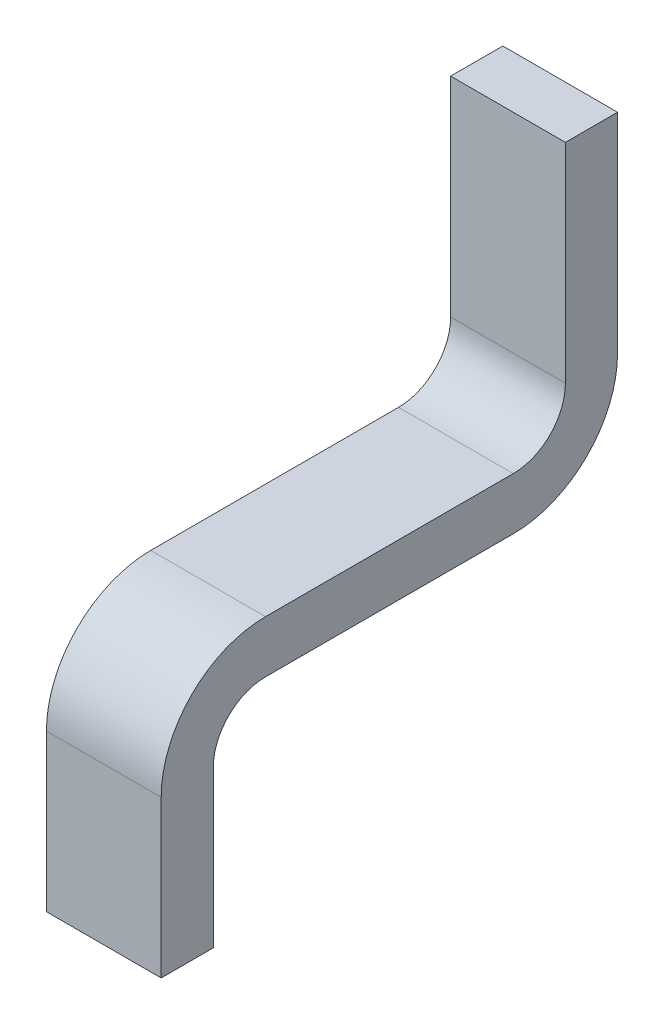
ISO-10303-21;
HEADER;
FILE_DESCRIPTION(('STEP AP214'),'2;1');
FILE_NAME('part.step','',(''),(''),'','','');
FILE_SCHEMA(('AUTOMOTIVE_DESIGN { 1 0 10303 214 1 1 1 1 }'));
ENDSEC;
DATA;
#1=APPLICATION_CONTEXT('core data for automotive mechanical design processes');
#2=APPLICATION_PROTOCOL_DEFINITION('international standard','automotive_design',2000,#1);
#3=PRODUCT_CONTEXT('',#1,'mechanical');
#4=PRODUCT('Part','Part','',(#3));
#5=PRODUCT_RELATED_PRODUCT_CATEGORY('part','',(#4));
#6=PRODUCT_DEFINITION_FORMATION('','',#4);
#7=PRODUCT_DEFINITION_CONTEXT('part definition',#1,'design');
#8=PRODUCT_DEFINITION('design','',#6,#7);
#9=PRODUCT_DEFINITION_SHAPE('','',#8);
#10=(LENGTH_UNIT() NAMED_UNIT(*) SI_UNIT(.MILLI.,.METRE.));
#11=(NAMED_UNIT(*) PLANE_ANGLE_UNIT() SI_UNIT($,.RADIAN.));
#12=(NAMED_UNIT(*) SI_UNIT($,.STERADIAN.) SOLID_ANGLE_UNIT());
#13=UNCERTAINTY_MEASURE_WITH_UNIT(LENGTH_MEASURE(1.E-05),#10,'distance_accuracy_value','');
#14=(GEOMETRIC_REPRESENTATION_CONTEXT(3) GLOBAL_UNCERTAINTY_ASSIGNED_CONTEXT((#13)) GLOBAL_UNIT_ASSIGNED_CONTEXT((#10,
#11,#12)) REPRESENTATION_CONTEXT('',''));
#15=CARTESIAN_POINT('',(0.,0.,0.));
#16=DIRECTION('',(0.,0.,1.));
#17=DIRECTION('',(1.,0.,0.));
#18=AXIS2_PLACEMENT_3D('',#15,#16,#17);
#19=CARTESIAN_POINT('',(-1.14,4.,0.675));
#20=DIRECTION('',(-1.,0.,0.));
#21=DIRECTION('',(0.,-1.,0.));
#22=AXIS2_PLACEMENT_3D('',#19,#20,#21);
#23=PLANE('',#22);
#24=CARTESIAN_POINT('',(-1.14,3.80000000000001,0.675));
#25=DIRECTION('',(1.,0.,0.));
#26=DIRECTION('',(0.,1.,0.));
#27=AXIS2_PLACEMENT_3D('',#24,#25,#26);
#28=CIRCLE('',#27,0.2);
#29=CARTESIAN_POINT('',(-1.14,3.80000000000001,0.875));
#30=VERTEX_POINT('',#29);
#31=CARTESIAN_POINT('',(-1.14,4.,0.675));
#32=VERTEX_POINT('',#31);
#33=EDGE_CURVE('E150',#30,#32,#28,.F.);
#34=ORIENTED_EDGE('',*,*,#33,.F.);
#35=DIRECTION('',(0.,1.,0.));
#36=VECTOR('',#35,1.);
#37=CARTESIAN_POINT('',(-1.14,3.5,0.875));
#38=LINE('',#37,#36);
#39=CARTESIAN_POINT('',(-1.14,3.5,0.875));
#40=VERTEX_POINT('',#39);
#41=EDGE_CURVE('E147',#30,#40,#38,.F.);
#42=ORIENTED_EDGE('',*,*,#41,.T.);
#43=DIRECTION('',(0.,0.,1.));
#44=VECTOR('',#43,1.);
#45=CARTESIAN_POINT('',(-1.14,3.5,0.775));
#46=LINE('',#45,#44);
#47=CARTESIAN_POINT('',(-1.14,3.5,0.775));
#48=VERTEX_POINT('',#47);
#49=EDGE_CURVE('E141',#48,#40,#46,.T.);
#50=ORIENTED_EDGE('',*,*,#49,.F.);
#51=DIRECTION('',(0.,1.,0.));
#52=VECTOR('',#51,1.);
#53=CARTESIAN_POINT('',(-1.14,3.5,0.775));
#54=LINE('',#53,#52);
#55=CARTESIAN_POINT('',(-1.14,3.80000000000001,0.775));
#56=VERTEX_POINT('',#55);
#57=EDGE_CURVE('E115',#48,#56,#54,.T.);
#58=ORIENTED_EDGE('',*,*,#57,.T.);
#59=CARTESIAN_POINT('',(-1.14,3.80000000000001,0.675));
#60=DIRECTION('',(1.,0.,0.));
#61=DIRECTION('',(0.,1.,0.));
#62=AXIS2_PLACEMENT_3D('',#59,#60,#61);
#63=CIRCLE('',#62,0.1);
#64=CARTESIAN_POINT('',(-1.14,3.9,0.675));
#65=VERTEX_POINT('',#64);
#66=EDGE_CURVE('E215',#56,#65,#63,.F.);
#67=ORIENTED_EDGE('',*,*,#66,.T.);
#68=DIRECTION('',(0.,0.,1.));
#69=VECTOR('',#68,1.);
#70=CARTESIAN_POINT('',(-1.14,3.9,0.675));
#71=LINE('',#70,#69);
#72=CARTESIAN_POINT('',(-1.14,3.9,0.2));
#73=VERTEX_POINT('',#72);
#74=EDGE_CURVE('E181',#65,#73,#71,.F.);
#75=ORIENTED_EDGE('',*,*,#74,.T.);
#76=CARTESIAN_POINT('',(-1.14,4.1,0.2));
#77=DIRECTION('',(-1.,0.,0.));
#78=DIRECTION('',(0.,-1.,0.));
#79=AXIS2_PLACEMENT_3D('',#76,#77,#78);
#80=CIRCLE('',#79,0.2);
#81=CARTESIAN_POINT('',(-1.14,4.1,0.));
#82=VERTEX_POINT('',#81);
#83=EDGE_CURVE('E20',#82,#73,#80,.T.);
#84=ORIENTED_EDGE('',*,*,#83,.F.);
#85=DIRECTION('',(0.,1.,0.));
#86=VECTOR('',#85,1.);
#87=CARTESIAN_POINT('',(-1.14,4.1,0.));
#88=LINE('',#87,#86);
#89=CARTESIAN_POINT('',(-1.14,4.5,0.));
#90=VERTEX_POINT('',#89);
#91=EDGE_CURVE('E91',#82,#90,#88,.T.);
#92=ORIENTED_EDGE('',*,*,#91,.T.);
#93=DIRECTION('',(0.,0.,1.));
#94=VECTOR('',#93,1.);
#95=CARTESIAN_POINT('',(-1.14,4.5,0.));
#96=LINE('',#95,#94);
#97=CARTESIAN_POINT('',(-1.14,4.5,0.1));
#98=VERTEX_POINT('',#97);
#99=EDGE_CURVE('E163',#90,#98,#96,.T.);
#100=ORIENTED_EDGE('',*,*,#99,.T.);
#101=DIRECTION('',(0.,1.,0.));
#102=VECTOR('',#101,1.);
#103=CARTESIAN_POINT('',(-1.14,4.1,0.1));
#104=LINE('',#103,#102);
#105=CARTESIAN_POINT('',(-1.14,4.1,0.1));
#106=VERTEX_POINT('',#105);
#107=EDGE_CURVE('E159',#98,#106,#104,.F.);
#108=ORIENTED_EDGE('',*,*,#107,.T.);
#109=CARTESIAN_POINT('',(-1.14,4.1,0.2));
#110=DIRECTION('',(-1.,0.,0.));
#111=DIRECTION('',(0.,-1.,0.));
#112=AXIS2_PLACEMENT_3D('',#109,#110,#111);
#113=CIRCLE('',#112,0.1);
#114=CARTESIAN_POINT('',(-1.14,4.,0.2));
#115=VERTEX_POINT('',#114);
#116=EDGE_CURVE('E155',#106,#115,#113,.T.);
#117=ORIENTED_EDGE('',*,*,#116,.T.);
#118=DIRECTION('',(0.,0.,1.));
#119=VECTOR('',#118,1.);
#120=CARTESIAN_POINT('',(-1.14,4.,0.675));
#121=LINE('',#120,#119);
#122=EDGE_CURVE('E154',#115,#32,#121,.T.);
#123=ORIENTED_EDGE('',*,*,#122,.T.);
#124=EDGE_LOOP('',(#34,#42,#50,#58,#67,#75,#84,#92,#100,#108,#117,#123));
#125=FACE_BOUND('',#124,.T.);
#126=ADVANCED_FACE('F17',(#125),#23,.F.);
#127=CARTESIAN_POINT('',(-1.14,4.1,0.2));
#128=DIRECTION('',(-1.,0.,0.));
#129=DIRECTION('',(0.,-1.,0.));
#130=AXIS2_PLACEMENT_3D('',#127,#128,#129);
#131=CYLINDRICAL_SURFACE('',#130,0.2);
#132=CARTESIAN_POINT('',(-1.36,4.1,0.2));
#133=DIRECTION('',(-1.,0.,0.));
#134=DIRECTION('',(0.,-1.,0.));
#135=AXIS2_PLACEMENT_3D('',#132,#133,#134);
#136=CIRCLE('',#135,0.2);
#137=CARTESIAN_POINT('',(-1.36,3.9,0.2));
#138=VERTEX_POINT('',#137);
#139=CARTESIAN_POINT('',(-1.36,4.1,0.));
#140=VERTEX_POINT('',#139);
#141=EDGE_CURVE('E183',#138,#140,#136,.F.);
#142=ORIENTED_EDGE('',*,*,#141,.T.);
#143=DIRECTION('',(1.,0.,0.));
#144=VECTOR('',#143,1.);
#145=CARTESIAN_POINT('',(-1.14,4.1,0.));
#146=LINE('',#145,#144);
#147=EDGE_CURVE('E178',#140,#82,#146,.T.);
#148=ORIENTED_EDGE('',*,*,#147,.T.);
#149=ORIENTED_EDGE('',*,*,#83,.T.);
#150=DIRECTION('',(-1.,0.,0.));
#151=VECTOR('',#150,1.);
#152=CARTESIAN_POINT('',(-1.14,3.9,0.2));
#153=LINE('',#152,#151);
#154=EDGE_CURVE('E217',#73,#138,#153,.T.);
#155=ORIENTED_EDGE('',*,*,#154,.T.);
#156=EDGE_LOOP('',(#142,#148,#149,#155));
#157=FACE_BOUND('',#156,.T.);
#158=ADVANCED_FACE('F254',(#157),#131,.T.);
#159=CARTESIAN_POINT('',(-1.14,4.1,0.));
#160=DIRECTION('',(0.,0.,1.));
#161=DIRECTION('',(1.,0.,0.));
#162=AXIS2_PLACEMENT_3D('',#159,#160,#161);
#163=PLANE('',#162);
#164=ORIENTED_EDGE('',*,*,#147,.F.);
#165=DIRECTION('',(0.,1.,0.));
#166=VECTOR('',#165,1.);
#167=CARTESIAN_POINT('',(-1.36,3.9,0.));
#168=LINE('',#167,#166);
#169=CARTESIAN_POINT('',(-1.36,4.5,0.));
#170=VERTEX_POINT('',#169);
#171=EDGE_CURVE('E170',#140,#170,#168,.T.);
#172=ORIENTED_EDGE('',*,*,#171,.T.);
#173=DIRECTION('',(1.,0.,0.));
#174=VECTOR('',#173,1.);
#175=CARTESIAN_POINT('',(-1.14,4.5,0.));
#176=LINE('',#175,#174);
#177=EDGE_CURVE('E173',#170,#90,#176,.T.);
#178=ORIENTED_EDGE('',*,*,#177,.T.);
#179=ORIENTED_EDGE('',*,*,#91,.F.);
#180=EDGE_LOOP('',(#164,#172,#178,#179));
#181=FACE_BOUND('',#180,.T.);
#182=ADVANCED_FACE('F257',(#181),#163,.F.);
#183=CARTESIAN_POINT('',(-1.14,4.5,0.));
#184=DIRECTION('',(0.,-1.,0.));
#185=DIRECTION('',(1.,0.,0.));
#186=AXIS2_PLACEMENT_3D('',#183,#184,#185);
#187=PLANE('',#186);
#188=DIRECTION('',(-1.,0.,0.));
#189=VECTOR('',#188,1.);
#190=CARTESIAN_POINT('',(-1.36,4.5,0.1));
#191=LINE('',#190,#189);
#192=CARTESIAN_POINT('',(-1.36,4.5,0.1));
#193=VERTEX_POINT('',#192);
#194=EDGE_CURVE('E160',#193,#98,#191,.F.);
#195=ORIENTED_EDGE('',*,*,#194,.T.);
#196=ORIENTED_EDGE('',*,*,#99,.F.);
#197=ORIENTED_EDGE('',*,*,#177,.F.);
#198=DIRECTION('',(0.,0.,1.));
#199=VECTOR('',#198,1.);
#200=CARTESIAN_POINT('',(-1.36,4.5,0.675));
#201=LINE('',#200,#199);
#202=EDGE_CURVE('E166',#170,#193,#201,.T.);
#203=ORIENTED_EDGE('',*,*,#202,.T.);
#204=EDGE_LOOP('',(#195,#196,#197,#203));
#205=FACE_BOUND('',#204,.T.);
#206=ADVANCED_FACE('F259',(#205),#187,.F.);
#207=CARTESIAN_POINT('',(-1.36,4.1,0.1));
#208=DIRECTION('',(0.,0.,-1.));
#209=DIRECTION('',(-1.,0.,0.));
#210=AXIS2_PLACEMENT_3D('',#207,#208,#209);
#211=PLANE('',#210);
#212=DIRECTION('',(-1.,0.,0.));
#213=VECTOR('',#212,1.);
#214=CARTESIAN_POINT('',(-1.36,4.1,0.1));
#215=LINE('',#214,#213);
#216=CARTESIAN_POINT('',(-1.36,4.1,0.1));
#217=VERTEX_POINT('',#216);
#218=EDGE_CURVE('E156',#217,#106,#215,.F.);
#219=ORIENTED_EDGE('',*,*,#218,.T.);
#220=ORIENTED_EDGE('',*,*,#107,.F.);
#221=ORIENTED_EDGE('',*,*,#194,.F.);
#222=DIRECTION('',(0.,1.,0.));
#223=VECTOR('',#222,1.);
#224=CARTESIAN_POINT('',(-1.36,3.9,0.1));
#225=LINE('',#224,#223);
#226=EDGE_CURVE('E169',#193,#217,#225,.F.);
#227=ORIENTED_EDGE('',*,*,#226,.T.);
#228=EDGE_LOOP('',(#219,#220,#221,#227));
#229=FACE_BOUND('',#228,.T.);
#230=ADVANCED_FACE('F234',(#229),#211,.F.);
#231=CARTESIAN_POINT('',(-1.36,4.1,0.2));
#232=DIRECTION('',(-1.,0.,0.));
#233=DIRECTION('',(0.,-1.,0.));
#234=AXIS2_PLACEMENT_3D('',#231,#232,#233);
#235=CYLINDRICAL_SURFACE('',#234,0.1);
#236=DIRECTION('',(1.,0.,0.));
#237=VECTOR('',#236,1.);
#238=CARTESIAN_POINT('',(-1.36,4.,0.2));
#239=LINE('',#238,#237);
#240=CARTESIAN_POINT('',(-1.36,4.,0.2));
#241=VERTEX_POINT('',#240);
#242=EDGE_CURVE('E151',#241,#115,#239,.T.);
#243=ORIENTED_EDGE('',*,*,#242,.T.);
#244=ORIENTED_EDGE('',*,*,#116,.F.);
#245=ORIENTED_EDGE('',*,*,#218,.F.);
#246=CARTESIAN_POINT('',(-1.36,4.1,0.2));
#247=DIRECTION('',(-1.,0.,0.));
#248=DIRECTION('',(0.,-1.,0.));
#249=AXIS2_PLACEMENT_3D('',#246,#247,#248);
#250=CIRCLE('',#249,0.1);
#251=EDGE_CURVE('E210',#217,#241,#250,.T.);
#252=ORIENTED_EDGE('',*,*,#251,.T.);
#253=EDGE_LOOP('',(#243,#244,#245,#252));
#254=FACE_BOUND('',#253,.T.);
#255=ADVANCED_FACE('F227',(#254),#235,.F.);
#256=CARTESIAN_POINT('',(-1.36,4.,0.675));
#257=DIRECTION('',(0.,-1.,0.));
#258=DIRECTION('',(1.,0.,0.));
#259=AXIS2_PLACEMENT_3D('',#256,#257,#258);
#260=PLANE('',#259);
#261=DIRECTION('',(1.,0.,0.));
#262=VECTOR('',#261,1.);
#263=CARTESIAN_POINT('',(-1.36,4.,0.675));
#264=LINE('',#263,#262);
#265=CARTESIAN_POINT('',(-1.36,4.,0.675));
#266=VERTEX_POINT('',#265);
#267=EDGE_CURVE('E148',#32,#266,#264,.F.);
#268=ORIENTED_EDGE('',*,*,#267,.F.);
#269=ORIENTED_EDGE('',*,*,#122,.F.);
#270=ORIENTED_EDGE('',*,*,#242,.F.);
#271=DIRECTION('',(0.,0.,1.));
#272=VECTOR('',#271,1.);
#273=CARTESIAN_POINT('',(-1.36,4.,0.675));
#274=LINE('',#273,#272);
#275=EDGE_CURVE('E209',#241,#266,#274,.T.);
#276=ORIENTED_EDGE('',*,*,#275,.T.);
#277=EDGE_LOOP('',(#268,#269,#270,#276));
#278=FACE_BOUND('',#277,.T.);
#279=ADVANCED_FACE('F224',(#278),#260,.F.);
#280=CARTESIAN_POINT('',(-1.36,3.8,0.675));
#281=DIRECTION('',(1.,0.,0.));
#282=DIRECTION('',(0.,1.,0.));
#283=AXIS2_PLACEMENT_3D('',#280,#281,#282);
#284=CYLINDRICAL_SURFACE('',#283,0.2);
#285=ORIENTED_EDGE('',*,*,#33,.T.);
#286=ORIENTED_EDGE('',*,*,#267,.T.);
#287=CARTESIAN_POINT('',(-1.36,3.8,0.675));
#288=DIRECTION('',(1.,0.,0.));
#289=DIRECTION('',(0.,1.,0.));
#290=AXIS2_PLACEMENT_3D('',#287,#288,#289);
#291=CIRCLE('',#290,0.2);
#292=CARTESIAN_POINT('',(-1.36,3.8,0.875));
#293=VERTEX_POINT('',#292);
#294=EDGE_CURVE('E133',#266,#293,#291,.T.);
#295=ORIENTED_EDGE('',*,*,#294,.T.);
#296=DIRECTION('',(-1.,0.,0.));
#297=VECTOR('',#296,1.);
#298=CARTESIAN_POINT('',(-1.36,3.8,0.875));
#299=LINE('',#298,#297);
#300=EDGE_CURVE('E144',#293,#30,#299,.F.);
#301=ORIENTED_EDGE('',*,*,#300,.T.);
#302=EDGE_LOOP('',(#285,#286,#295,#301));
#303=FACE_BOUND('',#302,.T.);
#304=ADVANCED_FACE('F285',(#303),#284,.T.);
#305=CARTESIAN_POINT('',(-1.36,3.5,0.875));
#306=DIRECTION('',(0.,0.,-1.));
#307=DIRECTION('',(-1.,0.,0.));
#308=AXIS2_PLACEMENT_3D('',#305,#306,#307);
#309=PLANE('',#308);
#310=DIRECTION('',(1.,0.,0.));
#311=VECTOR('',#310,1.);
#312=CARTESIAN_POINT('',(-1.14,3.5,0.875));
#313=LINE('',#312,#311);
#314=CARTESIAN_POINT('',(-1.36,3.5,0.875));
#315=VERTEX_POINT('',#314);
#316=EDGE_CURVE('E118',#40,#315,#313,.F.);
#317=ORIENTED_EDGE('',*,*,#316,.F.);
#318=ORIENTED_EDGE('',*,*,#41,.F.);
#319=ORIENTED_EDGE('',*,*,#300,.F.);
#320=DIRECTION('',(0.,1.,0.));
#321=VECTOR('',#320,1.);
#322=CARTESIAN_POINT('',(-1.36,3.9,0.875));
#323=LINE('',#322,#321);
#324=EDGE_CURVE('E131',#293,#315,#323,.F.);
#325=ORIENTED_EDGE('',*,*,#324,.T.);
#326=EDGE_LOOP('',(#317,#318,#319,#325));
#327=FACE_BOUND('',#326,.T.);
#328=ADVANCED_FACE('F282',(#327),#309,.F.);
#329=CARTESIAN_POINT('',(-1.14,3.5,0.775));
#330=DIRECTION('',(0.,-1.,0.));
#331=DIRECTION('',(1.,0.,0.));
#332=AXIS2_PLACEMENT_3D('',#329,#330,#331);
#333=PLANE('',#332);
#334=ORIENTED_EDGE('',*,*,#49,.T.);
#335=ORIENTED_EDGE('',*,*,#316,.T.);
#336=DIRECTION('',(0.,0.,1.));
#337=VECTOR('',#336,1.);
#338=CARTESIAN_POINT('',(-1.36,3.5,0.675));
#339=LINE('',#338,#337);
#340=CARTESIAN_POINT('',(-1.36,3.5,0.775));
#341=VERTEX_POINT('',#340);
#342=EDGE_CURVE('E125',#315,#341,#339,.F.);
#343=ORIENTED_EDGE('',*,*,#342,.T.);
#344=DIRECTION('',(1.,0.,0.));
#345=VECTOR('',#344,1.);
#346=CARTESIAN_POINT('',(-1.14,3.5,0.775));
#347=LINE('',#346,#345);
#348=EDGE_CURVE('E110',#341,#48,#347,.T.);
#349=ORIENTED_EDGE('',*,*,#348,.T.);
#350=EDGE_LOOP('',(#334,#335,#343,#349));
#351=FACE_BOUND('',#350,.T.);
#352=ADVANCED_FACE('F129',(#351),#333,.T.);
#353=CARTESIAN_POINT('',(-1.14,3.5,0.775));
#354=DIRECTION('',(0.,0.,1.));
#355=DIRECTION('',(1.,0.,0.));
#356=AXIS2_PLACEMENT_3D('',#353,#354,#355);
#357=PLANE('',#356);
#358=ORIENTED_EDGE('',*,*,#348,.F.);
#359=DIRECTION('',(0.,1.,0.));
#360=VECTOR('',#359,1.);
#361=CARTESIAN_POINT('',(-1.36,3.9,0.775));
#362=LINE('',#361,#360);
#363=CARTESIAN_POINT('',(-1.36,3.8,0.775));
#364=VERTEX_POINT('',#363);
#365=EDGE_CURVE('E114',#341,#364,#362,.T.);
#366=ORIENTED_EDGE('',*,*,#365,.T.);
#367=DIRECTION('',(1.,0.,0.));
#368=VECTOR('',#367,1.);
#369=CARTESIAN_POINT('',(-1.14,3.80000000000001,0.775));
#370=LINE('',#369,#368);
#371=EDGE_CURVE('E185',#364,#56,#370,.T.);
#372=ORIENTED_EDGE('',*,*,#371,.T.);
#373=ORIENTED_EDGE('',*,*,#57,.F.);
#374=EDGE_LOOP('',(#358,#366,#372,#373));
#375=FACE_BOUND('',#374,.T.);
#376=ADVANCED_FACE('F112',(#375),#357,.F.);
#377=CARTESIAN_POINT('',(-1.14,3.80000000000001,0.675));
#378=DIRECTION('',(1.,0.,0.));
#379=DIRECTION('',(0.,1.,0.));
#380=AXIS2_PLACEMENT_3D('',#377,#378,#379);
#381=CYLINDRICAL_SURFACE('',#380,0.1);
#382=ORIENTED_EDGE('',*,*,#371,.F.);
#383=CARTESIAN_POINT('',(-1.36,3.8,0.675));
#384=DIRECTION('',(1.,0.,0.));
#385=DIRECTION('',(0.,1.,0.));
#386=AXIS2_PLACEMENT_3D('',#383,#384,#385);
#387=CIRCLE('',#386,0.1);
#388=CARTESIAN_POINT('',(-1.36,3.9,0.675));
#389=VERTEX_POINT('',#388);
#390=EDGE_CURVE('E26',#364,#389,#387,.F.);
#391=ORIENTED_EDGE('',*,*,#390,.T.);
#392=DIRECTION('',(-1.,0.,0.));
#393=VECTOR('',#392,1.);
#394=CARTESIAN_POINT('',(-1.14,3.9,0.675));
#395=LINE('',#394,#393);
#396=EDGE_CURVE('E34',#389,#65,#395,.F.);
#397=ORIENTED_EDGE('',*,*,#396,.T.);
#398=ORIENTED_EDGE('',*,*,#66,.F.);
#399=EDGE_LOOP('',(#382,#391,#397,#398));
#400=FACE_BOUND('',#399,.T.);
#401=ADVANCED_FACE('F250',(#400),#381,.F.);
#402=CARTESIAN_POINT('',(-1.14,3.9,0.675));
#403=DIRECTION('',(0.,1.,0.));
#404=DIRECTION('',(-1.,0.,0.));
#405=AXIS2_PLACEMENT_3D('',#402,#403,#404);
#406=PLANE('',#405);
#407=ORIENTED_EDGE('',*,*,#396,.F.);
#408=DIRECTION('',(0.,0.,1.));
#409=VECTOR('',#408,1.);
#410=CARTESIAN_POINT('',(-1.36,3.9,0.675));
#411=LINE('',#410,#409);
#412=EDGE_CURVE('E11',#389,#138,#411,.F.);
#413=ORIENTED_EDGE('',*,*,#412,.T.);
#414=ORIENTED_EDGE('',*,*,#154,.F.);
#415=ORIENTED_EDGE('',*,*,#74,.F.);
#416=EDGE_LOOP('',(#407,#413,#414,#415));
#417=FACE_BOUND('',#416,.T.);
#418=ADVANCED_FACE('F252',(#417),#406,.F.);
#419=CARTESIAN_POINT('',(-1.36,3.9,0.675));
#420=DIRECTION('',(1.,0.,0.));
#421=DIRECTION('',(0.,1.,0.));
#422=AXIS2_PLACEMENT_3D('',#419,#420,#421);
#423=PLANE('',#422);
#424=ORIENTED_EDGE('',*,*,#390,.F.);
#425=ORIENTED_EDGE('',*,*,#365,.F.);
#426=ORIENTED_EDGE('',*,*,#342,.F.);
#427=ORIENTED_EDGE('',*,*,#324,.F.);
#428=ORIENTED_EDGE('',*,*,#294,.F.);
#429=ORIENTED_EDGE('',*,*,#275,.F.);
#430=ORIENTED_EDGE('',*,*,#251,.F.);
#431=ORIENTED_EDGE('',*,*,#226,.F.);
#432=ORIENTED_EDGE('',*,*,#202,.F.);
#433=ORIENTED_EDGE('',*,*,#171,.F.);
#434=ORIENTED_EDGE('',*,*,#141,.F.);
#435=ORIENTED_EDGE('',*,*,#412,.F.);
#436=EDGE_LOOP('',(#424,#425,#426,#427,#428,#429,#430,#431,#432,#433,#434,#435));
#437=FACE_BOUND('',#436,.T.);
#438=ADVANCED_FACE('F123',(#437),#423,.F.);
#439=CLOSED_SHELL('',(#126,#158,#182,#206,#230,#255,#279,#304,#328,#352,#376,#401,#418,#438));
#440=MANIFOLD_SOLID_BREP('B1',#439);
#441=ADVANCED_BREP_SHAPE_REPRESENTATION('',(#18,#440),#14);
#442=SHAPE_DEFINITION_REPRESENTATION(#9,#441);
ENDSEC;
END-ISO-10303-21;
